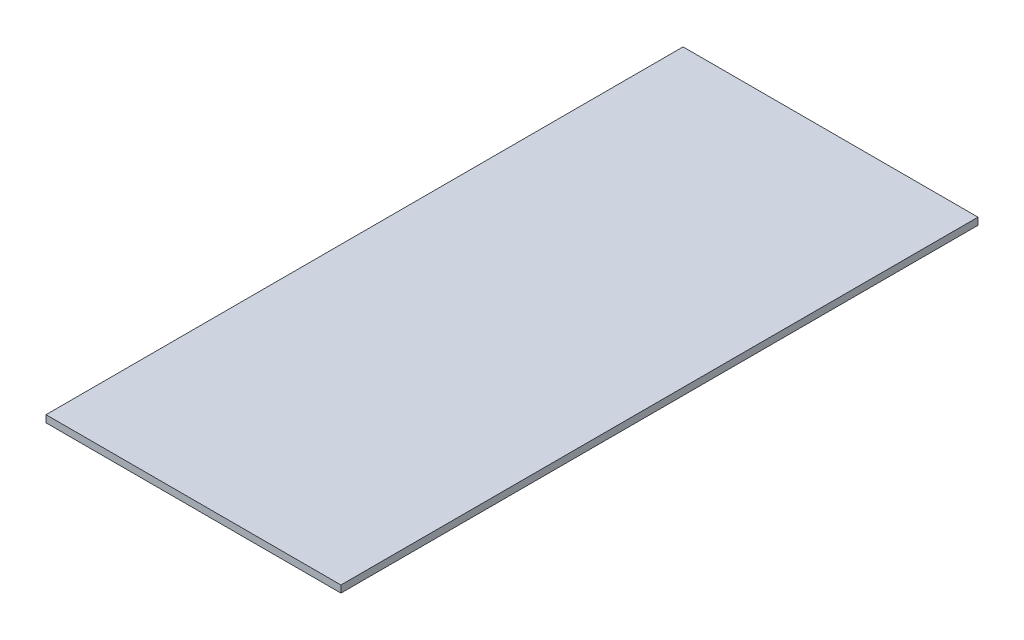
ISO-10303-21;
HEADER;
FILE_DESCRIPTION(('STEP AP214'),'2;1');
FILE_NAME('part.step','',(''),(''),'','','');
FILE_SCHEMA(('AUTOMOTIVE_DESIGN { 1 0 10303 214 1 1 1 1 }'));
ENDSEC;
DATA;
#1=APPLICATION_CONTEXT('core data for automotive mechanical design processes');
#2=APPLICATION_PROTOCOL_DEFINITION('international standard','automotive_design',2000,#1);
#3=PRODUCT_CONTEXT('',#1,'mechanical');
#4=PRODUCT('Part','Part','',(#3));
#5=PRODUCT_RELATED_PRODUCT_CATEGORY('part','',(#4));
#6=PRODUCT_DEFINITION_FORMATION('','',#4);
#7=PRODUCT_DEFINITION_CONTEXT('part definition',#1,'design');
#8=PRODUCT_DEFINITION('design','',#6,#7);
#9=PRODUCT_DEFINITION_SHAPE('','',#8);
#10=(LENGTH_UNIT() NAMED_UNIT(*) SI_UNIT(.MILLI.,.METRE.));
#11=(NAMED_UNIT(*) PLANE_ANGLE_UNIT() SI_UNIT($,.RADIAN.));
#12=(NAMED_UNIT(*) SI_UNIT($,.STERADIAN.) SOLID_ANGLE_UNIT());
#13=UNCERTAINTY_MEASURE_WITH_UNIT(LENGTH_MEASURE(1.E-05),#10,'distance_accuracy_value','');
#14=(GEOMETRIC_REPRESENTATION_CONTEXT(3) GLOBAL_UNCERTAINTY_ASSIGNED_CONTEXT((#13)) GLOBAL_UNIT_ASSIGNED_CONTEXT((#10,
#11,#12)) REPRESENTATION_CONTEXT('',''));
#15=CARTESIAN_POINT('',(0.,0.,0.));
#16=DIRECTION('',(0.,0.,1.));
#17=DIRECTION('',(1.,0.,0.));
#18=AXIS2_PLACEMENT_3D('',#15,#16,#17);
#19=CARTESIAN_POINT('',(0.,3.,0.));
#20=DIRECTION('',(1.,0.,0.));
#21=DIRECTION('',(0.,0.,-1.));
#22=AXIS2_PLACEMENT_3D('',#19,#20,#21);
#23=PLANE('',#22);
#24=DIRECTION('',(0.,0.,1.));
#25=VECTOR('',#24,1.);
#26=CARTESIAN_POINT('',(0.,0.,0.));
#27=LINE('',#26,#25);
#28=CARTESIAN_POINT('',(0.,0.,-270.));
#29=VERTEX_POINT('',#28);
#30=CARTESIAN_POINT('',(0.,0.,0.));
#31=VERTEX_POINT('',#30);
#32=EDGE_CURVE('E100',#29,#31,#27,.T.);
#33=ORIENTED_EDGE('',*,*,#32,.T.);
#34=DIRECTION('',(0.,-1.,0.));
#35=VECTOR('',#34,1.);
#36=CARTESIAN_POINT('',(0.,3.,0.));
#37=LINE('',#36,#35);
#38=CARTESIAN_POINT('',(0.,3.,0.));
#39=VERTEX_POINT('',#38);
#40=EDGE_CURVE('E11',#39,#31,#37,.T.);
#41=ORIENTED_EDGE('',*,*,#40,.F.);
#42=DIRECTION('',(0.,0.,1.));
#43=VECTOR('',#42,1.);
#44=CARTESIAN_POINT('',(0.,3.,0.));
#45=LINE('',#44,#43);
#46=CARTESIAN_POINT('',(0.,3.,-270.));
#47=VERTEX_POINT('',#46);
#48=EDGE_CURVE('E88',#47,#39,#45,.T.);
#49=ORIENTED_EDGE('',*,*,#48,.F.);
#50=DIRECTION('',(0.,-1.,0.));
#51=VECTOR('',#50,1.);
#52=CARTESIAN_POINT('',(0.,3.,-270.));
#53=LINE('',#52,#51);
#54=EDGE_CURVE('E96',#47,#29,#53,.T.);
#55=ORIENTED_EDGE('',*,*,#54,.T.);
#56=EDGE_LOOP('',(#33,#41,#49,#55));
#57=FACE_BOUND('',#56,.T.);
#58=ADVANCED_FACE('F37',(#57),#23,.F.);
#59=CARTESIAN_POINT('',(0.,3.,0.));
#60=DIRECTION('',(0.,0.,-1.));
#61=DIRECTION('',(-1.,0.,0.));
#62=AXIS2_PLACEMENT_3D('',#59,#60,#61);
#63=PLANE('',#62);
#64=DIRECTION('',(1.,0.,0.));
#65=VECTOR('',#64,1.);
#66=CARTESIAN_POINT('',(0.,0.,0.));
#67=LINE('',#66,#65);
#68=CARTESIAN_POINT('',(125.,0.,0.));
#69=VERTEX_POINT('',#68);
#70=EDGE_CURVE('E92',#31,#69,#67,.T.);
#71=ORIENTED_EDGE('',*,*,#70,.T.);
#72=DIRECTION('',(0.,-1.,0.));
#73=VECTOR('',#72,1.);
#74=CARTESIAN_POINT('',(125.,3.,0.));
#75=LINE('',#74,#73);
#76=CARTESIAN_POINT('',(125.,3.,0.));
#77=VERTEX_POINT('',#76);
#78=EDGE_CURVE('E45',#77,#69,#75,.T.);
#79=ORIENTED_EDGE('',*,*,#78,.F.);
#80=DIRECTION('',(1.,0.,0.));
#81=VECTOR('',#80,1.);
#82=CARTESIAN_POINT('',(0.,3.,0.));
#83=LINE('',#82,#81);
#84=EDGE_CURVE('E83',#39,#77,#83,.T.);
#85=ORIENTED_EDGE('',*,*,#84,.F.);
#86=ORIENTED_EDGE('',*,*,#40,.T.);
#87=EDGE_LOOP('',(#71,#79,#85,#86));
#88=FACE_BOUND('',#87,.T.);
#89=ADVANCED_FACE('F91',(#88),#63,.F.);
#90=CARTESIAN_POINT('',(125.,3.,0.));
#91=DIRECTION('',(-1.,0.,0.));
#92=DIRECTION('',(0.,0.,1.));
#93=AXIS2_PLACEMENT_3D('',#90,#91,#92);
#94=PLANE('',#93);
#95=DIRECTION('',(0.,0.,-1.));
#96=VECTOR('',#95,1.);
#97=CARTESIAN_POINT('',(125.,0.,0.));
#98=LINE('',#97,#96);
#99=CARTESIAN_POINT('',(125.,0.,-270.));
#100=VERTEX_POINT('',#99);
#101=EDGE_CURVE('E70',#69,#100,#98,.T.);
#102=ORIENTED_EDGE('',*,*,#101,.T.);
#103=DIRECTION('',(0.,-1.,0.));
#104=VECTOR('',#103,1.);
#105=CARTESIAN_POINT('',(125.,3.,-270.));
#106=LINE('',#105,#104);
#107=CARTESIAN_POINT('',(125.,3.,-270.));
#108=VERTEX_POINT('',#107);
#109=EDGE_CURVE('E93',#108,#100,#106,.T.);
#110=ORIENTED_EDGE('',*,*,#109,.F.);
#111=DIRECTION('',(0.,0.,-1.));
#112=VECTOR('',#111,1.);
#113=CARTESIAN_POINT('',(125.,3.,0.));
#114=LINE('',#113,#112);
#115=EDGE_CURVE('E86',#77,#108,#114,.T.);
#116=ORIENTED_EDGE('',*,*,#115,.F.);
#117=ORIENTED_EDGE('',*,*,#78,.T.);
#118=EDGE_LOOP('',(#102,#110,#116,#117));
#119=FACE_BOUND('',#118,.T.);
#120=ADVANCED_FACE('F94',(#119),#94,.F.);
#121=CARTESIAN_POINT('',(0.,3.,-270.));
#122=DIRECTION('',(0.,0.,1.));
#123=DIRECTION('',(1.,0.,0.));
#124=AXIS2_PLACEMENT_3D('',#121,#122,#123);
#125=PLANE('',#124);
#126=DIRECTION('',(-1.,0.,0.));
#127=VECTOR('',#126,1.);
#128=CARTESIAN_POINT('',(0.,0.,-270.));
#129=LINE('',#128,#127);
#130=EDGE_CURVE('E76',#100,#29,#129,.T.);
#131=ORIENTED_EDGE('',*,*,#130,.T.);
#132=ORIENTED_EDGE('',*,*,#54,.F.);
#133=DIRECTION('',(-1.,0.,0.));
#134=VECTOR('',#133,1.);
#135=CARTESIAN_POINT('',(0.,3.,-270.));
#136=LINE('',#135,#134);
#137=EDGE_CURVE('E53',#108,#47,#136,.T.);
#138=ORIENTED_EDGE('',*,*,#137,.F.);
#139=ORIENTED_EDGE('',*,*,#109,.T.);
#140=EDGE_LOOP('',(#131,#132,#138,#139));
#141=FACE_BOUND('',#140,.T.);
#142=ADVANCED_FACE('F107',(#141),#125,.F.);
#143=CARTESIAN_POINT('',(0.,3.,0.));
#144=DIRECTION('',(0.,-1.,0.));
#145=DIRECTION('',(0.,0.,-1.));
#146=AXIS2_PLACEMENT_3D('',#143,#144,#145);
#147=PLANE('',#146);
#148=ORIENTED_EDGE('',*,*,#48,.T.);
#149=ORIENTED_EDGE('',*,*,#84,.T.);
#150=ORIENTED_EDGE('',*,*,#115,.T.);
#151=ORIENTED_EDGE('',*,*,#137,.T.);
#152=EDGE_LOOP('',(#148,#149,#150,#151));
#153=FACE_BOUND('',#152,.T.);
#154=ADVANCED_FACE('F84',(#153),#147,.F.);
#155=CARTESIAN_POINT('',(0.,0.,0.));
#156=DIRECTION('',(0.,-1.,0.));
#157=DIRECTION('',(0.,0.,-1.));
#158=AXIS2_PLACEMENT_3D('',#155,#156,#157);
#159=PLANE('',#158);
#160=ORIENTED_EDGE('',*,*,#32,.F.);
#161=ORIENTED_EDGE('',*,*,#130,.F.);
#162=ORIENTED_EDGE('',*,*,#101,.F.);
#163=ORIENTED_EDGE('',*,*,#70,.F.);
#164=EDGE_LOOP('',(#160,#161,#162,#163));
#165=FACE_BOUND('',#164,.T.);
#166=ADVANCED_FACE('F110',(#165),#159,.T.);
#167=CLOSED_SHELL('',(#58,#89,#120,#142,#154,#166));
#168=MANIFOLD_SOLID_BREP('B2',#167);
#169=ADVANCED_BREP_SHAPE_REPRESENTATION('',(#18,#168),#14);
#170=SHAPE_DEFINITION_REPRESENTATION(#9,#169);
ENDSEC;
END-ISO-10303-21;
